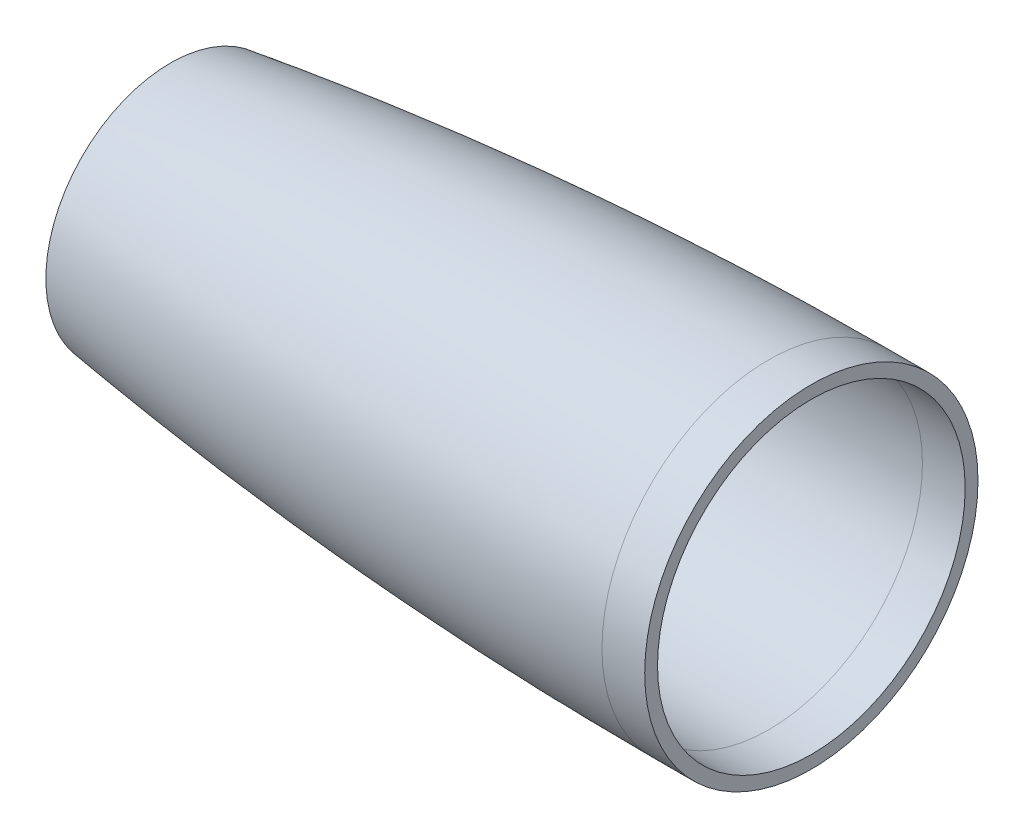
ISO-10303-21;
HEADER;
FILE_DESCRIPTION(('STEP AP214'),'2;1');
FILE_NAME('part.step','',(''),(''),'','','');
FILE_SCHEMA(('AUTOMOTIVE_DESIGN { 1 0 10303 214 1 1 1 1 }'));
ENDSEC;
DATA;
#1=APPLICATION_CONTEXT('core data for automotive mechanical design processes');
#2=APPLICATION_PROTOCOL_DEFINITION('international standard','automotive_design',2000,#1);
#3=PRODUCT_CONTEXT('',#1,'mechanical');
#4=PRODUCT('Part','Part','',(#3));
#5=PRODUCT_RELATED_PRODUCT_CATEGORY('part','',(#4));
#6=PRODUCT_DEFINITION_FORMATION('','',#4);
#7=PRODUCT_DEFINITION_CONTEXT('part definition',#1,'design');
#8=PRODUCT_DEFINITION('design','',#6,#7);
#9=PRODUCT_DEFINITION_SHAPE('','',#8);
#10=(LENGTH_UNIT() NAMED_UNIT(*) SI_UNIT(.MILLI.,.METRE.));
#11=(NAMED_UNIT(*) PLANE_ANGLE_UNIT() SI_UNIT($,.RADIAN.));
#12=(NAMED_UNIT(*) SI_UNIT($,.STERADIAN.) SOLID_ANGLE_UNIT());
#13=UNCERTAINTY_MEASURE_WITH_UNIT(LENGTH_MEASURE(1.E-05),#10,'distance_accuracy_value','');
#14=(GEOMETRIC_REPRESENTATION_CONTEXT(3) GLOBAL_UNCERTAINTY_ASSIGNED_CONTEXT((#13)) GLOBAL_UNIT_ASSIGNED_CONTEXT((#10,
#11,#12)) REPRESENTATION_CONTEXT('',''));
#15=CARTESIAN_POINT('',(0.,0.,0.));
#16=DIRECTION('',(0.,0.,1.));
#17=DIRECTION('',(1.,0.,0.));
#18=AXIS2_PLACEMENT_3D('',#15,#16,#17);
#19=CARTESIAN_POINT('',(558.800000053401,0.,-1.2699999732944));
#20=DIRECTION('',(-1.,0.,0.));
#21=DIRECTION('',(0.,0.,1.));
#22=AXIS2_PLACEMENT_3D('',#19,#20,#21);
#23=CYLINDRICAL_SURFACE('',#22,49.53);
#24=CARTESIAN_POINT('',(355.600000053401,0.,-1.26999997329437));
#25=DIRECTION('',(1.,0.,0.));
#26=DIRECTION('',(0.,0.,-1.));
#27=AXIS2_PLACEMENT_3D('',#24,#25,#26);
#28=CIRCLE('',#27,49.53);
#29=CARTESIAN_POINT('',(355.600000053401,0.,-50.7999999732944));
#30=VERTEX_POINT('',#29);
#31=EDGE_CURVE('E10',#30,#30,#28,.T.);
#32=ORIENTED_EDGE('',*,*,#31,.T.);
#33=EDGE_LOOP('',(#32));
#34=FACE_BOUND('',#33,.T.);
#35=CARTESIAN_POINT('',(368.300000053401,0.,-1.26999997329437));
#36=DIRECTION('',(1.,0.,0.));
#37=DIRECTION('',(0.,0.,-1.));
#38=AXIS2_PLACEMENT_3D('',#35,#36,#37);
#39=CIRCLE('',#38,49.53);
#40=CARTESIAN_POINT('',(368.300000053401,0.,-50.7999999732944));
#41=VERTEX_POINT('',#40);
#42=EDGE_CURVE('E49',#41,#41,#39,.T.);
#43=ORIENTED_EDGE('',*,*,#42,.F.);
#44=EDGE_LOOP('',(#43));
#45=FACE_BOUND('',#44,.T.);
#46=ADVANCED_FACE('F41',(#34,#45),#23,.T.);
#47=CARTESIAN_POINT('',(355.600000087303,0.,-50.7999999734738));
#48=CARTESIAN_POINT('',(355.162608624885,0.,-50.7999999735659));
#49=CARTESIAN_POINT('',(354.282013928467,0.,-50.7994231748212));
#50=CARTESIAN_POINT('',(352.40570494871,0.,-50.7968275800228));
#51=CARTESIAN_POINT('',(350.344714481144,0.,-50.7899060027044));
#52=CARTESIAN_POINT('',(348.272494467081,0.,-50.7795236600886));
#53=CARTESIAN_POINT('',(346.163273231363,0.,-50.7656805804724));
#54=CARTESIAN_POINT('',(344.069774299166,0.,-50.748376801568));
#55=CARTESIAN_POINT('',(341.973247657925,0.,-50.7276123705328));
#56=CARTESIAN_POINT('',(339.329601827273,0.,-50.6970642265401));
#57=CARTESIAN_POINT('',(336.139078074932,0.,-50.6530928887572));
#58=CARTESIAN_POINT('',(332.401425999425,0.,-50.5911161036849));
#59=CARTESIAN_POINT('',(328.11696662755,0.,-50.5056092089642));
#60=CARTESIAN_POINT('',(323.832782668936,0.,-50.4056458049246));
#61=CARTESIAN_POINT('',(319.548981494171,0.,-50.2912270295979));
#62=CARTESIAN_POINT('',(315.265578413362,0.,-50.1623541856019));
#63=CARTESIAN_POINT('',(308.841173655417,0.,-49.9473660179873));
#64=CARTESIAN_POINT('',(299.206459448119,0.,-49.5706926353229));
#65=CARTESIAN_POINT('',(262.82240565497,0.,-47.8202304215008));
#66=CARTESIAN_POINT('',(219.035004800648,0.,-44.081341124365));
#67=CARTESIAN_POINT('',(168.000757519809,0.,-37.5160414552513));
#68=CARTESIAN_POINT('',(119.48562917264,0.,-28.8169974598621));
#69=CARTESIAN_POINT('',(97.4339898112845,0.,-24.3488229238283));
#70=CARTESIAN_POINT('',(82.7791362290027,0.,-21.1556615214593));
#71=CARTESIAN_POINT('',(77.5504414103591,0.,-19.9917100931957));
#72=CARTESIAN_POINT('',(73.3706786134794,0.,-19.0464466097069));
#73=CARTESIAN_POINT('',(69.7273952025031,0.,-18.2095760773824));
#74=CARTESIAN_POINT('',(66.6195661782511,0.,-17.4865360850931));
#75=CARTESIAN_POINT('',(64.0458560302311,0.,-16.881716673034));
#76=CARTESIAN_POINT('',(62.0056186070266,0.,-16.3987071516188));
#77=CARTESIAN_POINT('',(59.9691674563714,0.,-15.9130688516041));
#78=CARTESIAN_POINT('',(57.9182040289449,0.,-15.4202778528841));
#79=CARTESIAN_POINT('',(55.9042897804765,0.,-14.9330814332139));
#80=CARTESIAN_POINT('',(53.9013161125411,0.,-14.4450248471193));
#81=CARTESIAN_POINT('',(52.0797481244347,0.,-13.9973601803948));
#82=CARTESIAN_POINT('',(51.224607869347,0.,-13.7865417030788));
#83=CARTESIAN_POINT('',(50.8000000794835,0.,-13.6815677480592));
#84=B_SPLINE_CURVE_WITH_KNOTS('',4,(#47,#48,#49,#50,#51,#52,#53,#54,#55,#56,#57,#58,#59,#60,#61,
#62,#63,#64,#65,#66,#67,#68,#69,#70,#71,#72,#73,#74,#75,#76,#77,#78,#79,#80,#81,#82,#83),
.UNSPECIFIED.,.F.,.F.,(5,1,1,1,1,1,1,1,1,1,1,1,1,1,1,1,1,1,1,1,1,1,1,1,1,1,1,1,1,1,1,1,1,5),
(0.0828265796694398,0.0885105936404642,0.0941946077216388,0.0998786218028135,0.105562635883988,
0.111246649965163,0.116930664046338,0.122614678127512,0.128298692208687,0.139917178769152,
0.151535665329618,0.163154151890083,0.174772638450548,0.186391125129919,0.198009611809289,
0.20962809848866,0.244483558329257,0.290957504236502,0.593038155059935,0.685986046686238,
0.802170914093339,0.825407884941349,0.837026372593241,0.848644860245132,0.860263347897024,
0.871881835548916,0.877565849853662,0.883249864158408,0.888933878463154,0.8946178927679,
0.900301907072646,0.905985921377392,0.911669935682138,0.917353950101889),.UNSPECIFIED.);
#85=CARTESIAN_POINT('',(355.600000053401,0.,-1.26999997329437));
#86=DIRECTION('',(1.,0.,0.));
#87=AXIS1_PLACEMENT('',#85,#86);
#88=SURFACE_OF_REVOLUTION('',#84,#87);
#89=CARTESIAN_POINT('',(177.800000053401,0.,-1.26999997329435));
#90=DIRECTION('',(1.,0.,0.));
#91=DIRECTION('',(0.,0.,-1.));
#92=AXIS2_PLACEMENT_3D('',#89,#90,#91);
#93=CIRCLE('',#92,37.0224088166855);
#94=CARTESIAN_POINT('',(177.800000053401,0.,-38.2924087899798));
#95=VERTEX_POINT('',#94);
#96=EDGE_CURVE('E44',#95,#95,#93,.F.);
#97=ORIENTED_EDGE('',*,*,#96,.F.);
#98=EDGE_LOOP('',(#97));
#99=FACE_BOUND('',#98,.T.);
#100=ORIENTED_EDGE('',*,*,#31,.F.);
#101=EDGE_LOOP('',(#100));
#102=FACE_BOUND('',#101,.T.);
#103=ADVANCED_FACE('F66',(#99,#102),#88,.F.);
#104=CARTESIAN_POINT('',(368.300000053401,0.,-1.26999997329437));
#105=DIRECTION('',(1.,0.,0.));
#106=DIRECTION('',(0.,0.,-1.));
#107=AXIS2_PLACEMENT_3D('',#104,#105,#106);
#108=PLANE('',#107);
#109=CARTESIAN_POINT('',(368.300000053401,0.,-1.26999997329437));
#110=DIRECTION('',(1.,0.,0.));
#111=DIRECTION('',(0.,0.,-1.));
#112=AXIS2_PLACEMENT_3D('',#109,#110,#111);
#113=CIRCLE('',#112,45.72);
#114=CARTESIAN_POINT('',(368.300000053401,0.,-46.9899999732944));
#115=VERTEX_POINT('',#114);
#116=EDGE_CURVE('E145',#115,#115,#113,.T.);
#117=ORIENTED_EDGE('',*,*,#116,.F.);
#118=EDGE_LOOP('',(#117));
#119=FACE_BOUND('',#118,.T.);
#120=ORIENTED_EDGE('',*,*,#42,.T.);
#121=EDGE_LOOP('',(#120));
#122=FACE_BOUND('',#121,.T.);
#123=ADVANCED_FACE('F71',(#119,#122),#108,.T.);
#124=CARTESIAN_POINT('',(177.800000053401,0.,-1.26999997329435));
#125=DIRECTION('',(1.,0.,0.));
#126=DIRECTION('',(0.,0.,-1.));
#127=AXIS2_PLACEMENT_3D('',#124,#125,#126);
#128=PLANE('',#127);
#129=CARTESIAN_POINT('',(177.800000053401,0.,-1.26999997329435));
#130=DIRECTION('',(1.,0.,0.));
#131=DIRECTION('',(0.,0.,-1.));
#132=AXIS2_PLACEMENT_3D('',#129,#130,#131);
#133=CIRCLE('',#132,33.1743970844118);
#134=CARTESIAN_POINT('',(177.800000053401,0.,-34.4443970577061));
#135=VERTEX_POINT('',#134);
#136=EDGE_CURVE('E60',#135,#135,#133,.F.);
#137=ORIENTED_EDGE('',*,*,#136,.F.);
#138=EDGE_LOOP('',(#137));
#139=FACE_BOUND('',#138,.T.);
#140=ORIENTED_EDGE('',*,*,#96,.T.);
#141=EDGE_LOOP('',(#140));
#142=FACE_BOUND('',#141,.T.);
#143=ADVANCED_FACE('F75',(#139,#142),#128,.F.);
#144=CARTESIAN_POINT('',(558.800000053401,0.,-1.2699999732944));
#145=DIRECTION('',(-1.,0.,0.));
#146=DIRECTION('',(0.,0.,1.));
#147=AXIS2_PLACEMENT_3D('',#144,#145,#146);
#148=CYLINDRICAL_SURFACE('',#147,45.72);
#149=CARTESIAN_POINT('',(355.600000053401,0.,-1.26999997329437));
#150=DIRECTION('',(-1.,0.,0.));
#151=DIRECTION('',(0.,0.,1.));
#152=AXIS2_PLACEMENT_3D('',#149,#150,#151);
#153=CIRCLE('',#152,45.72);
#154=CARTESIAN_POINT('',(355.600000053401,0.,44.4500000267056));
#155=VERTEX_POINT('',#154);
#156=EDGE_CURVE('E143',#155,#155,#153,.F.);
#157=ORIENTED_EDGE('',*,*,#156,.F.);
#158=EDGE_LOOP('',(#157));
#159=FACE_BOUND('',#158,.T.);
#160=ORIENTED_EDGE('',*,*,#116,.T.);
#161=EDGE_LOOP('',(#160));
#162=FACE_BOUND('',#161,.T.);
#163=ADVANCED_FACE('F77',(#159,#162),#148,.F.);
#164=CARTESIAN_POINT('',(355.600000087303,0.,-50.7999999734738));
#165=CARTESIAN_POINT('',(355.162608624885,0.,-50.7999999735659));
#166=CARTESIAN_POINT('',(354.282013928467,0.,-50.7994231748212));
#167=CARTESIAN_POINT('',(352.40570494871,0.,-50.7968275800228));
#168=CARTESIAN_POINT('',(350.344714481144,0.,-50.7899060027044));
#169=CARTESIAN_POINT('',(348.272494467081,0.,-50.7795236600886));
#170=CARTESIAN_POINT('',(346.163273231363,0.,-50.7656805804724));
#171=CARTESIAN_POINT('',(344.069774299166,0.,-50.748376801568));
#172=CARTESIAN_POINT('',(341.973247657925,0.,-50.7276123705328));
#173=CARTESIAN_POINT('',(339.329601827273,0.,-50.6970642265401));
#174=CARTESIAN_POINT('',(336.139078074932,0.,-50.6530928887572));
#175=CARTESIAN_POINT('',(332.401425999425,0.,-50.5911161036849));
#176=CARTESIAN_POINT('',(328.11696662755,0.,-50.5056092089642));
#177=CARTESIAN_POINT('',(323.832782668936,0.,-50.4056458049246));
#178=CARTESIAN_POINT('',(319.548981494171,0.,-50.2912270295979));
#179=CARTESIAN_POINT('',(315.265578413362,0.,-50.1623541856019));
#180=CARTESIAN_POINT('',(308.841173655417,0.,-49.9473660179873));
#181=CARTESIAN_POINT('',(299.206459448119,0.,-49.5706926353229));
#182=CARTESIAN_POINT('',(262.82240565497,0.,-47.8202304215008));
#183=CARTESIAN_POINT('',(219.035004800648,0.,-44.081341124365));
#184=CARTESIAN_POINT('',(168.000757519809,0.,-37.5160414552513));
#185=CARTESIAN_POINT('',(119.48562917264,0.,-28.8169974598621));
#186=CARTESIAN_POINT('',(97.4339898112845,0.,-24.3488229238283));
#187=CARTESIAN_POINT('',(82.7791362290027,0.,-21.1556615214593));
#188=CARTESIAN_POINT('',(77.5504414103591,0.,-19.9917100931957));
#189=CARTESIAN_POINT('',(73.3706786134794,0.,-19.0464466097069));
#190=CARTESIAN_POINT('',(69.7273952025031,0.,-18.2095760773824));
#191=CARTESIAN_POINT('',(66.6195661782511,0.,-17.4865360850931));
#192=CARTESIAN_POINT('',(64.0458560302311,0.,-16.881716673034));
#193=CARTESIAN_POINT('',(62.0056186070266,0.,-16.3987071516188));
#194=CARTESIAN_POINT('',(59.9691674563714,0.,-15.9130688516041));
#195=CARTESIAN_POINT('',(57.9182040289449,0.,-15.4202778528841));
#196=CARTESIAN_POINT('',(55.9042897804765,0.,-14.9330814332139));
#197=CARTESIAN_POINT('',(53.9013161125411,0.,-14.4450248471193));
#198=CARTESIAN_POINT('',(52.0797481244347,0.,-13.9973601803948));
#199=CARTESIAN_POINT('',(51.224607869347,0.,-13.7865417030788));
#200=CARTESIAN_POINT('',(50.8000000794835,0.,-13.6815677480592));
#201=B_SPLINE_CURVE_WITH_KNOTS('',4,(#164,#165,#166,#167,#168,#169,#170,#171,#172,#173,#174,
#175,#176,#177,#178,#179,#180,#181,#182,#183,#184,#185,#186,#187,#188,#189,#190,#191,#192,#193,
#194,#195,#196,#197,#198,#199,#200),.UNSPECIFIED.,.F.,.F.,(5,1,1,1,1,1,1,1,1,1,1,1,1,1,1,1,1,1,
1,1,1,1,1,1,1,1,1,1,1,1,1,1,1,5),(0.0828265796694398,0.0885105936404642,0.0941946077216388,
0.0998786218028135,0.105562635883988,0.111246649965163,0.116930664046338,0.122614678127512,
0.128298692208687,0.139917178769152,0.151535665329618,0.163154151890083,0.174772638450548,
0.186391125129919,0.198009611809289,0.20962809848866,0.244483558329257,0.290957504236502,
0.593038155059935,0.685986046686238,0.802170914093339,0.825407884941349,0.837026372593241,
0.848644860245132,0.860263347897024,0.871881835548916,0.877565849853662,0.883249864158408,
0.888933878463154,0.8946178927679,0.900301907072646,0.905985921377392,0.911669935682138,
0.917353950101889),.UNSPECIFIED.);
#202=CARTESIAN_POINT('',(355.600000053401,0.,-1.26999997329437));
#203=DIRECTION('',(1.,0.,0.));
#204=AXIS1_PLACEMENT('',#202,#203);
#205=SURFACE_OF_REVOLUTION('',#201,#204);
#206=OFFSET_SURFACE('',#205,3.81,.F.);
#207=ORIENTED_EDGE('',*,*,#136,.T.);
#208=EDGE_LOOP('',(#207));
#209=FACE_BOUND('',#208,.T.);
#210=ORIENTED_EDGE('',*,*,#156,.T.);
#211=EDGE_LOOP('',(#210));
#212=FACE_BOUND('',#211,.T.);
#213=ADVANCED_FACE('F73',(#209,#212),#206,.T.);
#214=CLOSED_SHELL('',(#46,#103,#123,#143,#163,#213));
#215=MANIFOLD_SOLID_BREP('B2',#214);
#216=ADVANCED_BREP_SHAPE_REPRESENTATION('',(#18,#215),#14);
#217=SHAPE_DEFINITION_REPRESENTATION(#9,#216);
ENDSEC;
END-ISO-10303-21;
